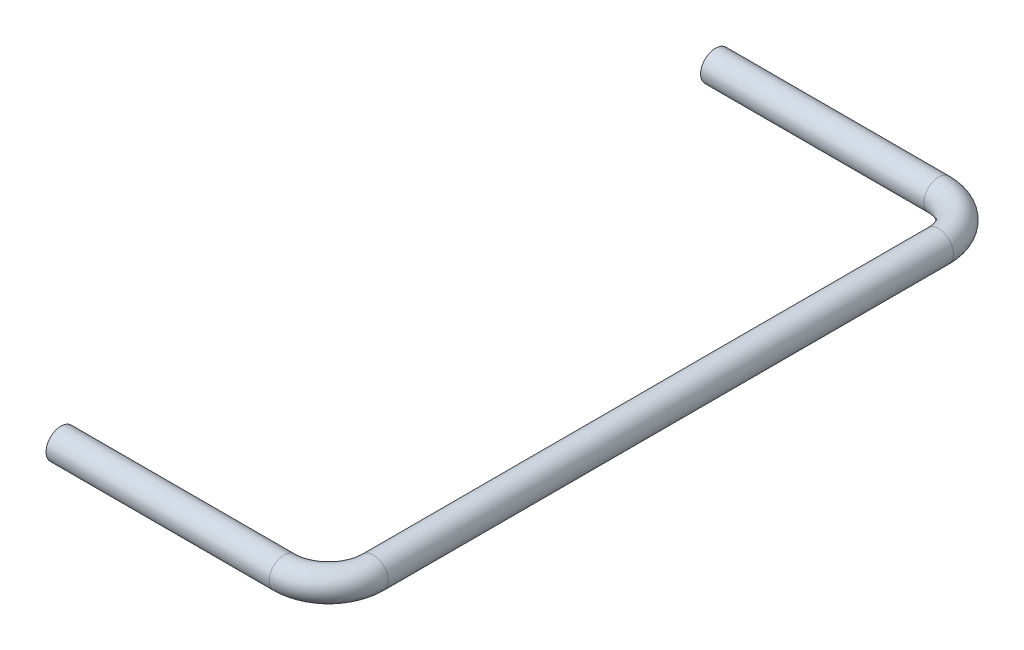
ISO-10303-21;
HEADER;
FILE_DESCRIPTION(('STEP AP214'),'2;1');
FILE_NAME('part.step','',(''),(''),'','','');
FILE_SCHEMA(('AUTOMOTIVE_DESIGN { 1 0 10303 214 1 1 1 1 }'));
ENDSEC;
DATA;
#1=APPLICATION_CONTEXT('core data for automotive mechanical design processes');
#2=APPLICATION_PROTOCOL_DEFINITION('international standard','automotive_design',2000,#1);
#3=PRODUCT_CONTEXT('',#1,'mechanical');
#4=PRODUCT('Part','Part','',(#3));
#5=PRODUCT_RELATED_PRODUCT_CATEGORY('part','',(#4));
#6=PRODUCT_DEFINITION_FORMATION('','',#4);
#7=PRODUCT_DEFINITION_CONTEXT('part definition',#1,'design');
#8=PRODUCT_DEFINITION('design','',#6,#7);
#9=PRODUCT_DEFINITION_SHAPE('','',#8);
#10=(LENGTH_UNIT() NAMED_UNIT(*) SI_UNIT(.MILLI.,.METRE.));
#11=(NAMED_UNIT(*) PLANE_ANGLE_UNIT() SI_UNIT($,.RADIAN.));
#12=(NAMED_UNIT(*) SI_UNIT($,.STERADIAN.) SOLID_ANGLE_UNIT());
#13=UNCERTAINTY_MEASURE_WITH_UNIT(LENGTH_MEASURE(1.E-05),#10,'distance_accuracy_value','');
#14=(GEOMETRIC_REPRESENTATION_CONTEXT(3) GLOBAL_UNCERTAINTY_ASSIGNED_CONTEXT((#13)) GLOBAL_UNIT_ASSIGNED_CONTEXT((#10,
#11,#12)) REPRESENTATION_CONTEXT('',''));
#15=CARTESIAN_POINT('',(0.,0.,0.));
#16=DIRECTION('',(0.,0.,1.));
#17=DIRECTION('',(1.,0.,0.));
#18=AXIS2_PLACEMENT_3D('',#15,#16,#17);
#19=CARTESIAN_POINT('',(15.,0.,-44.));
#20=DIRECTION('',(-1.,0.,0.));
#21=DIRECTION('',(0.,0.,1.));
#22=AXIS2_PLACEMENT_3D('',#19,#20,#21);
#23=CYLINDRICAL_SURFACE('',#22,1.);
#24=CARTESIAN_POINT('',(15.,0.,-44.));
#25=DIRECTION('',(-1.,0.,0.));
#26=DIRECTION('',(0.,0.,1.));
#27=AXIS2_PLACEMENT_3D('',#24,#25,#26);
#28=CIRCLE('',#27,1.);
#29=CARTESIAN_POINT('',(15.,0.,-45.));
#30=VERTEX_POINT('',#29);
#31=EDGE_CURVE('E38',#30,#30,#28,.T.);
#32=ORIENTED_EDGE('',*,*,#31,.T.);
#33=EDGE_LOOP('',(#32));
#34=FACE_BOUND('',#33,.T.);
#35=CARTESIAN_POINT('',(0.,0.,-44.));
#36=DIRECTION('',(-1.,0.,0.));
#37=DIRECTION('',(0.,0.,1.));
#38=AXIS2_PLACEMENT_3D('',#35,#36,#37);
#39=CIRCLE('',#38,1.);
#40=CARTESIAN_POINT('',(0.,0.,-43.));
#41=VERTEX_POINT('',#40);
#42=EDGE_CURVE('E10',#41,#41,#39,.T.);
#43=ORIENTED_EDGE('',*,*,#42,.F.);
#44=EDGE_LOOP('',(#43));
#45=FACE_BOUND('',#44,.T.);
#46=ADVANCED_FACE('F32',(#34,#45),#23,.T.);
#47=CARTESIAN_POINT('',(15.,0.,-41.));
#48=DIRECTION('',(0.,1.,0.));
#49=DIRECTION('',(0.,0.,1.));
#50=AXIS2_PLACEMENT_3D('',#47,#48,#49);
#51=TOROIDAL_SURFACE('',#50,3.,1.);
#52=CARTESIAN_POINT('',(18.,0.,-41.));
#53=DIRECTION('',(0.,0.,-1.));
#54=DIRECTION('',(-1.,0.,0.));
#55=AXIS2_PLACEMENT_3D('',#52,#53,#54);
#56=CIRCLE('',#55,1.);
#57=CARTESIAN_POINT('',(19.,0.,-41.));
#58=VERTEX_POINT('',#57);
#59=EDGE_CURVE('E42',#58,#58,#56,.T.);
#60=CARTESIAN_POINT('',(15.,0.,-41.));
#61=DIRECTION('',(0.,1.,0.));
#62=DIRECTION('',(0.,0.,1.));
#63=AXIS2_PLACEMENT_3D('',#60,#61,#62);
#64=CIRCLE('',#63,4.);
#65=EDGE_CURVE('',#58,#30,#64,.T.);
#66=ORIENTED_EDGE('',*,*,#59,.T.);
#67=ORIENTED_EDGE('',*,*,#31,.F.);
#68=ORIENTED_EDGE('',*,*,#65,.T.);
#69=ORIENTED_EDGE('',*,*,#65,.F.);
#70=EDGE_LOOP('',(#66,#68,#67,#69));
#71=FACE_BOUND('',#70,.T.);
#72=ADVANCED_FACE('F76',(#71),#51,.T.);
#73=CARTESIAN_POINT('',(18.,0.,-3.));
#74=DIRECTION('',(0.,0.,-1.));
#75=DIRECTION('',(-1.,0.,0.));
#76=AXIS2_PLACEMENT_3D('',#73,#74,#75);
#77=CYLINDRICAL_SURFACE('',#76,1.);
#78=CARTESIAN_POINT('',(18.,0.,-3.));
#79=DIRECTION('',(0.,0.,-1.));
#80=DIRECTION('',(-1.,0.,0.));
#81=AXIS2_PLACEMENT_3D('',#78,#79,#80);
#82=CIRCLE('',#81,1.);
#83=CARTESIAN_POINT('',(19.,0.,-3.));
#84=VERTEX_POINT('',#83);
#85=EDGE_CURVE('E46',#84,#84,#82,.T.);
#86=ORIENTED_EDGE('',*,*,#85,.T.);
#87=EDGE_LOOP('',(#86));
#88=FACE_BOUND('',#87,.T.);
#89=ORIENTED_EDGE('',*,*,#59,.F.);
#90=EDGE_LOOP('',(#89));
#91=FACE_BOUND('',#90,.T.);
#92=ADVANCED_FACE('F80',(#88,#91),#77,.T.);
#93=CARTESIAN_POINT('',(15.,0.,-3.));
#94=DIRECTION('',(0.,1.,0.));
#95=DIRECTION('',(0.,0.,1.));
#96=AXIS2_PLACEMENT_3D('',#93,#94,#95);
#97=TOROIDAL_SURFACE('',#96,3.,1.);
#98=CARTESIAN_POINT('',(15.,0.,0.));
#99=DIRECTION('',(1.,0.,0.));
#100=DIRECTION('',(0.,0.,-1.));
#101=AXIS2_PLACEMENT_3D('',#98,#99,#100);
#102=CIRCLE('',#101,1.);
#103=CARTESIAN_POINT('',(15.,0.,1.));
#104=VERTEX_POINT('',#103);
#105=EDGE_CURVE('E51',#104,#104,#102,.T.);
#106=CARTESIAN_POINT('',(15.,0.,-3.));
#107=DIRECTION('',(0.,1.,0.));
#108=DIRECTION('',(0.,0.,1.));
#109=AXIS2_PLACEMENT_3D('',#106,#107,#108);
#110=CIRCLE('',#109,4.);
#111=EDGE_CURVE('',#104,#84,#110,.T.);
#112=ORIENTED_EDGE('',*,*,#105,.T.);
#113=ORIENTED_EDGE('',*,*,#85,.F.);
#114=ORIENTED_EDGE('',*,*,#111,.T.);
#115=ORIENTED_EDGE('',*,*,#111,.F.);
#116=EDGE_LOOP('',(#112,#114,#113,#115));
#117=FACE_BOUND('',#116,.T.);
#118=ADVANCED_FACE('F58',(#117),#97,.T.);
#119=CARTESIAN_POINT('',(15.,0.,0.));
#120=DIRECTION('',(-1.,0.,0.));
#121=DIRECTION('',(0.,0.,1.));
#122=AXIS2_PLACEMENT_3D('',#119,#120,#121);
#123=CYLINDRICAL_SURFACE('',#122,1.);
#124=ORIENTED_EDGE('',*,*,#105,.F.);
#125=EDGE_LOOP('',(#124));
#126=FACE_BOUND('',#125,.T.);
#127=CARTESIAN_POINT('',(0.,0.,0.));
#128=DIRECTION('',(1.,0.,0.));
#129=DIRECTION('',(0.,0.,-1.));
#130=AXIS2_PLACEMENT_3D('',#127,#128,#129);
#131=CIRCLE('',#130,1.);
#132=CARTESIAN_POINT('',(0.,0.,-1.));
#133=VERTEX_POINT('',#132);
#134=EDGE_CURVE('E52',#133,#133,#131,.T.);
#135=ORIENTED_EDGE('',*,*,#134,.T.);
#136=EDGE_LOOP('',(#135));
#137=FACE_BOUND('',#136,.T.);
#138=ADVANCED_FACE('F61',(#126,#137),#123,.T.);
#139=CARTESIAN_POINT('',(0.,0.,-44.));
#140=DIRECTION('',(-1.,0.,0.));
#141=DIRECTION('',(0.,0.,1.));
#142=AXIS2_PLACEMENT_3D('',#139,#140,#141);
#143=PLANE('',#142);
#144=ORIENTED_EDGE('',*,*,#42,.T.);
#145=EDGE_LOOP('',(#144));
#146=FACE_BOUND('',#145,.T.);
#147=ADVANCED_FACE('F64',(#146),#143,.T.);
#148=CARTESIAN_POINT('',(0.,0.,0.));
#149=DIRECTION('',(1.,0.,0.));
#150=DIRECTION('',(0.,0.,-1.));
#151=AXIS2_PLACEMENT_3D('',#148,#149,#150);
#152=PLANE('',#151);
#153=ORIENTED_EDGE('',*,*,#134,.F.);
#154=EDGE_LOOP('',(#153));
#155=FACE_BOUND('',#154,.T.);
#156=ADVANCED_FACE('F68',(#155),#152,.F.);
#157=CLOSED_SHELL('',(#46,#72,#92,#118,#138,#147,#156));
#158=MANIFOLD_SOLID_BREP('B2',#157);
#159=ADVANCED_BREP_SHAPE_REPRESENTATION('',(#18,#158),#14);
#160=SHAPE_DEFINITION_REPRESENTATION(#9,#159);
ENDSEC;
END-ISO-10303-21;
